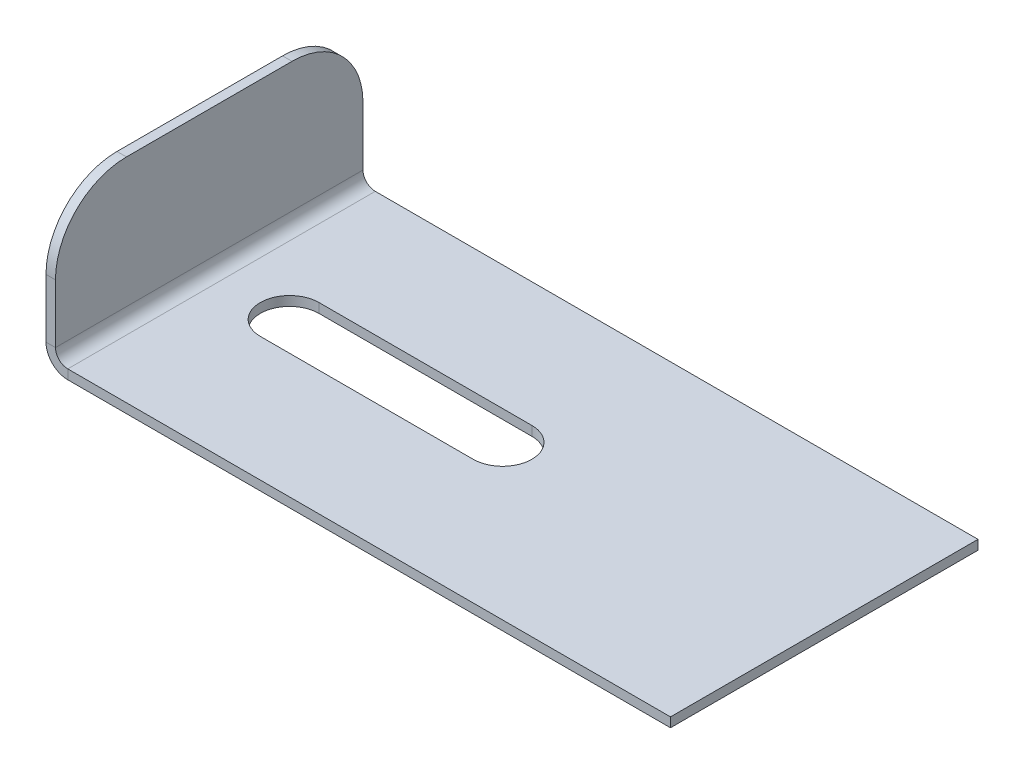
ISO-10303-21;
HEADER;
FILE_DESCRIPTION(('STEP AP214'),'2;1');
FILE_NAME('part.step','',(''),(''),'','','');
FILE_SCHEMA(('AUTOMOTIVE_DESIGN { 1 0 10303 214 1 1 1 1 }'));
ENDSEC;
DATA;
#1=APPLICATION_CONTEXT('core data for automotive mechanical design processes');
#2=APPLICATION_PROTOCOL_DEFINITION('international standard','automotive_design',2000,#1);
#3=PRODUCT_CONTEXT('',#1,'mechanical');
#4=PRODUCT('Part','Part','',(#3));
#5=PRODUCT_RELATED_PRODUCT_CATEGORY('part','',(#4));
#6=PRODUCT_DEFINITION_FORMATION('','',#4);
#7=PRODUCT_DEFINITION_CONTEXT('part definition',#1,'design');
#8=PRODUCT_DEFINITION('design','',#6,#7);
#9=PRODUCT_DEFINITION_SHAPE('','',#8);
#10=(LENGTH_UNIT() NAMED_UNIT(*) SI_UNIT(.MILLI.,.METRE.));
#11=(NAMED_UNIT(*) PLANE_ANGLE_UNIT() SI_UNIT($,.RADIAN.));
#12=(NAMED_UNIT(*) SI_UNIT($,.STERADIAN.) SOLID_ANGLE_UNIT());
#13=UNCERTAINTY_MEASURE_WITH_UNIT(LENGTH_MEASURE(1.E-05),#10,'distance_accuracy_value','');
#14=(GEOMETRIC_REPRESENTATION_CONTEXT(3) GLOBAL_UNCERTAINTY_ASSIGNED_CONTEXT((#13)) GLOBAL_UNIT_ASSIGNED_CONTEXT((#10,
#11,#12)) REPRESENTATION_CONTEXT('',''));
#15=CARTESIAN_POINT('',(0.,0.,0.));
#16=DIRECTION('',(0.,0.,1.));
#17=DIRECTION('',(1.,0.,0.));
#18=AXIS2_PLACEMENT_3D('',#15,#16,#17);
#19=CARTESIAN_POINT('',(-48.,0.,-6.2));
#20=DIRECTION('',(0.,0.,1.));
#21=DIRECTION('',(-1.,0.,0.));
#22=AXIS2_PLACEMENT_3D('',#19,#20,#21);
#23=PLANE('',#22);
#24=DIRECTION('',(0.,1.,0.));
#25=VECTOR('',#24,1.);
#26=CARTESIAN_POINT('',(-48.,0.,-6.2));
#27=LINE('',#26,#25);
#28=CARTESIAN_POINT('',(-48.,-2.,-6.2));
#29=VERTEX_POINT('',#28);
#30=CARTESIAN_POINT('',(-48.,0.,-6.2));
#31=VERTEX_POINT('',#30);
#32=EDGE_CURVE('E11',#29,#31,#27,.T.);
#33=ORIENTED_EDGE('',*,*,#32,.F.);
#34=DIRECTION('',(1.,0.,0.));
#35=VECTOR('',#34,1.);
#36=CARTESIAN_POINT('',(0.,-2.,-6.2));
#37=LINE('',#36,#35);
#38=CARTESIAN_POINT('',(-2.99999999999999,-2.,-6.2));
#39=VERTEX_POINT('',#38);
#40=EDGE_CURVE('E129',#39,#29,#37,.F.);
#41=ORIENTED_EDGE('',*,*,#40,.F.);
#42=DIRECTION('',(0.,1.,0.));
#43=VECTOR('',#42,1.);
#44=CARTESIAN_POINT('',(-2.99999999999999,0.,-6.2));
#45=LINE('',#44,#43);
#46=CARTESIAN_POINT('',(-2.99999999999999,0.,-6.2));
#47=VERTEX_POINT('',#46);
#48=EDGE_CURVE('E51',#39,#47,#45,.T.);
#49=ORIENTED_EDGE('',*,*,#48,.T.);
#50=DIRECTION('',(-1.,0.,0.));
#51=VECTOR('',#50,1.);
#52=CARTESIAN_POINT('',(-48.,0.,-6.2));
#53=LINE('',#52,#51);
#54=EDGE_CURVE('E179',#47,#31,#53,.T.);
#55=ORIENTED_EDGE('',*,*,#54,.T.);
#56=EDGE_LOOP('',(#33,#41,#49,#55));
#57=FACE_BOUND('',#56,.T.);
#58=ADVANCED_FACE('F41',(#57),#23,.T.);
#59=CARTESIAN_POINT('',(-2.99999999999999,0.,0.));
#60=DIRECTION('',(0.,-1.,0.));
#61=DIRECTION('',(0.,0.,-1.));
#62=AXIS2_PLACEMENT_3D('',#59,#60,#61);
#63=CYLINDRICAL_SURFACE('',#62,6.2);
#64=ORIENTED_EDGE('',*,*,#48,.F.);
#65=CARTESIAN_POINT('',(-2.99999999999999,-2.,0.));
#66=DIRECTION('',(0.,1.,0.));
#67=DIRECTION('',(0.,0.,1.));
#68=AXIS2_PLACEMENT_3D('',#65,#66,#67);
#69=CIRCLE('',#68,6.2);
#70=CARTESIAN_POINT('',(-2.99999999999999,-2.,6.2));
#71=VERTEX_POINT('',#70);
#72=EDGE_CURVE('E141',#71,#39,#69,.T.);
#73=ORIENTED_EDGE('',*,*,#72,.F.);
#74=DIRECTION('',(0.,1.,0.));
#75=VECTOR('',#74,1.);
#76=CARTESIAN_POINT('',(-2.99999999999999,0.,6.2));
#77=LINE('',#76,#75);
#78=CARTESIAN_POINT('',(-2.99999999999999,0.,6.2));
#79=VERTEX_POINT('',#78);
#80=EDGE_CURVE('E120',#71,#79,#77,.T.);
#81=ORIENTED_EDGE('',*,*,#80,.T.);
#82=CARTESIAN_POINT('',(-2.99999999999999,0.,0.));
#83=DIRECTION('',(0.,1.,0.));
#84=DIRECTION('',(0.,0.,1.));
#85=AXIS2_PLACEMENT_3D('',#82,#83,#84);
#86=CIRCLE('',#85,6.2);
#87=EDGE_CURVE('E188',#79,#47,#86,.T.);
#88=ORIENTED_EDGE('',*,*,#87,.T.);
#89=EDGE_LOOP('',(#64,#73,#81,#88));
#90=FACE_BOUND('',#89,.T.);
#91=ADVANCED_FACE('F191',(#90),#63,.F.);
#92=CARTESIAN_POINT('',(-48.,0.,6.2));
#93=DIRECTION('',(0.,0.,-1.));
#94=DIRECTION('',(1.,0.,0.));
#95=AXIS2_PLACEMENT_3D('',#92,#93,#94);
#96=PLANE('',#95);
#97=ORIENTED_EDGE('',*,*,#80,.F.);
#98=DIRECTION('',(1.,0.,0.));
#99=VECTOR('',#98,1.);
#100=CARTESIAN_POINT('',(0.,-2.,6.2));
#101=LINE('',#100,#99);
#102=CARTESIAN_POINT('',(-48.,-2.,6.2));
#103=VERTEX_POINT('',#102);
#104=EDGE_CURVE('E127',#103,#71,#101,.T.);
#105=ORIENTED_EDGE('',*,*,#104,.F.);
#106=DIRECTION('',(0.,1.,0.));
#107=VECTOR('',#106,1.);
#108=CARTESIAN_POINT('',(-48.,0.,6.2));
#109=LINE('',#108,#107);
#110=CARTESIAN_POINT('',(-48.,0.,6.2));
#111=VERTEX_POINT('',#110);
#112=EDGE_CURVE('E45',#103,#111,#109,.T.);
#113=ORIENTED_EDGE('',*,*,#112,.T.);
#114=DIRECTION('',(1.,0.,0.));
#115=VECTOR('',#114,1.);
#116=CARTESIAN_POINT('',(-48.,0.,6.2));
#117=LINE('',#116,#115);
#118=EDGE_CURVE('E270',#111,#79,#117,.T.);
#119=ORIENTED_EDGE('',*,*,#118,.T.);
#120=EDGE_LOOP('',(#97,#105,#113,#119));
#121=FACE_BOUND('',#120,.T.);
#122=ADVANCED_FACE('F132',(#121),#96,.T.);
#123=CARTESIAN_POINT('',(-65.,15.,-17.5));
#124=DIRECTION('',(-1.,0.,0.));
#125=DIRECTION('',(0.,-1.,0.));
#126=AXIS2_PLACEMENT_3D('',#123,#124,#125);
#127=CYLINDRICAL_SURFACE('',#126,15.);
#128=DIRECTION('',(1.,0.,0.));
#129=VECTOR('',#128,1.);
#130=CARTESIAN_POINT('',(-65.,15.,-32.5));
#131=LINE('',#130,#129);
#132=CARTESIAN_POINT('',(-67.,15.,-32.5));
#133=VERTEX_POINT('',#132);
#134=CARTESIAN_POINT('',(-65.,15.,-32.5));
#135=VERTEX_POINT('',#134);
#136=EDGE_CURVE('E121',#133,#135,#131,.T.);
#137=ORIENTED_EDGE('',*,*,#136,.F.);
#138=CARTESIAN_POINT('',(-67.,15.,-17.5));
#139=DIRECTION('',(-1.,0.,0.));
#140=DIRECTION('',(0.,-1.,0.));
#141=AXIS2_PLACEMENT_3D('',#138,#139,#140);
#142=CIRCLE('',#141,15.);
#143=CARTESIAN_POINT('',(-67.0000000000001,30.,-17.5));
#144=VERTEX_POINT('',#143);
#145=EDGE_CURVE('E281',#133,#144,#142,.F.);
#146=ORIENTED_EDGE('',*,*,#145,.T.);
#147=DIRECTION('',(1.,0.,0.));
#148=VECTOR('',#147,1.);
#149=CARTESIAN_POINT('',(-65.0000000000001,30.,-17.5));
#150=LINE('',#149,#148);
#151=CARTESIAN_POINT('',(-65.0000000000001,30.,-17.5));
#152=VERTEX_POINT('',#151);
#153=EDGE_CURVE('E167',#144,#152,#150,.T.);
#154=ORIENTED_EDGE('',*,*,#153,.T.);
#155=CARTESIAN_POINT('',(-65.,15.,-17.5));
#156=DIRECTION('',(-1.,0.,0.));
#157=DIRECTION('',(0.,-1.,0.));
#158=AXIS2_PLACEMENT_3D('',#155,#156,#157);
#159=CIRCLE('',#158,15.);
#160=EDGE_CURVE('E217',#135,#152,#159,.F.);
#161=ORIENTED_EDGE('',*,*,#160,.F.);
#162=EDGE_LOOP('',(#137,#146,#154,#161));
#163=FACE_BOUND('',#162,.T.);
#164=ADVANCED_FACE('F349',(#163),#127,.T.);
#165=CARTESIAN_POINT('',(-65.0000000000001,30.,32.5));
#166=DIRECTION('',(0.,-1.,0.));
#167=DIRECTION('',(0.,0.,1.));
#168=AXIS2_PLACEMENT_3D('',#165,#166,#167);
#169=PLANE('',#168);
#170=ORIENTED_EDGE('',*,*,#153,.F.);
#171=DIRECTION('',(0.,0.,1.));
#172=VECTOR('',#171,1.);
#173=CARTESIAN_POINT('',(-67.0000000000001,30.,0.));
#174=LINE('',#173,#172);
#175=CARTESIAN_POINT('',(-67.0000000000001,30.,17.5));
#176=VERTEX_POINT('',#175);
#177=EDGE_CURVE('E278',#144,#176,#174,.T.);
#178=ORIENTED_EDGE('',*,*,#177,.T.);
#179=DIRECTION('',(1.,0.,0.));
#180=VECTOR('',#179,1.);
#181=CARTESIAN_POINT('',(-65.0000000000001,30.,17.5));
#182=LINE('',#181,#180);
#183=CARTESIAN_POINT('',(-65.0000000000001,30.,17.5));
#184=VERTEX_POINT('',#183);
#185=EDGE_CURVE('E164',#176,#184,#182,.T.);
#186=ORIENTED_EDGE('',*,*,#185,.T.);
#187=DIRECTION('',(0.,0.,1.));
#188=VECTOR('',#187,1.);
#189=CARTESIAN_POINT('',(-65.0000000000001,30.,32.5));
#190=LINE('',#189,#188);
#191=EDGE_CURVE('E221',#152,#184,#190,.T.);
#192=ORIENTED_EDGE('',*,*,#191,.F.);
#193=EDGE_LOOP('',(#170,#178,#186,#192));
#194=FACE_BOUND('',#193,.T.);
#195=ADVANCED_FACE('F351',(#194),#169,.F.);
#196=CARTESIAN_POINT('',(-65.,15.,17.5));
#197=DIRECTION('',(-1.,0.,0.));
#198=DIRECTION('',(0.,-1.,0.));
#199=AXIS2_PLACEMENT_3D('',#196,#197,#198);
#200=CYLINDRICAL_SURFACE('',#199,15.);
#201=ORIENTED_EDGE('',*,*,#185,.F.);
#202=CARTESIAN_POINT('',(-67.,15.,17.5));
#203=DIRECTION('',(-1.,0.,0.));
#204=DIRECTION('',(0.,-1.,0.));
#205=AXIS2_PLACEMENT_3D('',#202,#203,#204);
#206=CIRCLE('',#205,15.);
#207=CARTESIAN_POINT('',(-67.,15.,32.5));
#208=VERTEX_POINT('',#207);
#209=EDGE_CURVE('E274',#176,#208,#206,.F.);
#210=ORIENTED_EDGE('',*,*,#209,.T.);
#211=DIRECTION('',(1.,0.,0.));
#212=VECTOR('',#211,1.);
#213=CARTESIAN_POINT('',(-65.,15.,32.5));
#214=LINE('',#213,#212);
#215=CARTESIAN_POINT('',(-65.,15.,32.5));
#216=VERTEX_POINT('',#215);
#217=EDGE_CURVE('E161',#208,#216,#214,.T.);
#218=ORIENTED_EDGE('',*,*,#217,.T.);
#219=CARTESIAN_POINT('',(-65.,15.,17.5));
#220=DIRECTION('',(-1.,0.,0.));
#221=DIRECTION('',(0.,-1.,0.));
#222=AXIS2_PLACEMENT_3D('',#219,#220,#221);
#223=CIRCLE('',#222,15.);
#224=EDGE_CURVE('E225',#184,#216,#223,.F.);
#225=ORIENTED_EDGE('',*,*,#224,.F.);
#226=EDGE_LOOP('',(#201,#210,#218,#225));
#227=FACE_BOUND('',#226,.T.);
#228=ADVANCED_FACE('F337',(#227),#200,.T.);
#229=CARTESIAN_POINT('',(-65.,0.,32.5));
#230=DIRECTION('',(0.,0.,-1.));
#231=DIRECTION('',(0.,-1.,0.));
#232=AXIS2_PLACEMENT_3D('',#229,#230,#231);
#233=PLANE('',#232);
#234=ORIENTED_EDGE('',*,*,#217,.F.);
#235=DIRECTION('',(0.,-1.,0.));
#236=VECTOR('',#235,1.);
#237=CARTESIAN_POINT('',(-67.,-2.47949808832952E-13,32.5));
#238=LINE('',#237,#236);
#239=CARTESIAN_POINT('',(-67.,2.59999999999998,32.5));
#240=VERTEX_POINT('',#239);
#241=EDGE_CURVE('E252',#208,#240,#238,.T.);
#242=ORIENTED_EDGE('',*,*,#241,.T.);
#243=DIRECTION('',(1.,0.,0.));
#244=VECTOR('',#243,1.);
#245=CARTESIAN_POINT('',(-65.,2.59999999999999,32.5));
#246=LINE('',#245,#244);
#247=CARTESIAN_POINT('',(-65.,2.59999999999999,32.5));
#248=VERTEX_POINT('',#247);
#249=EDGE_CURVE('E159',#240,#248,#246,.T.);
#250=ORIENTED_EDGE('',*,*,#249,.T.);
#251=DIRECTION('',(0.,-1.,0.));
#252=VECTOR('',#251,1.);
#253=CARTESIAN_POINT('',(-65.,0.,32.5));
#254=LINE('',#253,#252);
#255=EDGE_CURVE('E229',#216,#248,#254,.T.);
#256=ORIENTED_EDGE('',*,*,#255,.F.);
#257=EDGE_LOOP('',(#234,#242,#250,#256));
#258=FACE_BOUND('',#257,.T.);
#259=ADVANCED_FACE('F345',(#258),#233,.F.);
#260=CARTESIAN_POINT('',(-62.4,2.6,32.5));
#261=DIRECTION('',(0.,0.,-1.));
#262=DIRECTION('',(-1.,0.,0.));
#263=AXIS2_PLACEMENT_3D('',#260,#261,#262);
#264=PLANE('',#263);
#265=ORIENTED_EDGE('',*,*,#249,.F.);
#266=CARTESIAN_POINT('',(-62.4,2.6,32.5));
#267=DIRECTION('',(0.,0.,1.));
#268=DIRECTION('',(1.,0.,0.));
#269=AXIS2_PLACEMENT_3D('',#266,#267,#268);
#270=CIRCLE('',#269,4.6);
#271=CARTESIAN_POINT('',(-62.4,-2.,32.5));
#272=VERTEX_POINT('',#271);
#273=EDGE_CURVE('E255',#240,#272,#270,.T.);
#274=ORIENTED_EDGE('',*,*,#273,.T.);
#275=DIRECTION('',(0.,1.,0.));
#276=VECTOR('',#275,1.);
#277=CARTESIAN_POINT('',(-62.4,0.,32.5));
#278=LINE('',#277,#276);
#279=CARTESIAN_POINT('',(-62.4,0.,32.5));
#280=VERTEX_POINT('',#279);
#281=EDGE_CURVE('E156',#272,#280,#278,.T.);
#282=ORIENTED_EDGE('',*,*,#281,.T.);
#283=CARTESIAN_POINT('',(-62.4,2.6,32.5));
#284=DIRECTION('',(0.,0.,1.));
#285=DIRECTION('',(1.,0.,0.));
#286=AXIS2_PLACEMENT_3D('',#283,#284,#285);
#287=CIRCLE('',#286,2.6);
#288=EDGE_CURVE('E173',#248,#280,#287,.T.);
#289=ORIENTED_EDGE('',*,*,#288,.F.);
#290=EDGE_LOOP('',(#265,#274,#282,#289));
#291=FACE_BOUND('',#290,.T.);
#292=ADVANCED_FACE('F347',(#291),#264,.F.);
#293=CARTESIAN_POINT('',(-65.,0.,32.5));
#294=DIRECTION('',(0.,0.,-1.));
#295=DIRECTION('',(1.,0.,0.));
#296=AXIS2_PLACEMENT_3D('',#293,#294,#295);
#297=PLANE('',#296);
#298=ORIENTED_EDGE('',*,*,#281,.F.);
#299=DIRECTION('',(1.,0.,0.));
#300=VECTOR('',#299,1.);
#301=CARTESIAN_POINT('',(0.,-2.,32.5));
#302=LINE('',#301,#300);
#303=CARTESIAN_POINT('',(65.,-2.,32.5));
#304=VERTEX_POINT('',#303);
#305=EDGE_CURVE('E246',#272,#304,#302,.T.);
#306=ORIENTED_EDGE('',*,*,#305,.T.);
#307=DIRECTION('',(0.,1.,0.));
#308=VECTOR('',#307,1.);
#309=CARTESIAN_POINT('',(65.,0.,32.5));
#310=LINE('',#309,#308);
#311=CARTESIAN_POINT('',(65.,0.,32.5));
#312=VERTEX_POINT('',#311);
#313=EDGE_CURVE('E153',#304,#312,#310,.T.);
#314=ORIENTED_EDGE('',*,*,#313,.T.);
#315=DIRECTION('',(1.,0.,0.));
#316=VECTOR('',#315,1.);
#317=CARTESIAN_POINT('',(-65.,0.,32.5));
#318=LINE('',#317,#316);
#319=EDGE_CURVE('E198',#280,#312,#318,.T.);
#320=ORIENTED_EDGE('',*,*,#319,.F.);
#321=EDGE_LOOP('',(#298,#306,#314,#320));
#322=FACE_BOUND('',#321,.T.);
#323=ADVANCED_FACE('F320',(#322),#297,.F.);
#324=CARTESIAN_POINT('',(65.,0.,32.5));
#325=DIRECTION('',(-1.,0.,0.));
#326=DIRECTION('',(0.,0.,-1.));
#327=AXIS2_PLACEMENT_3D('',#324,#325,#326);
#328=PLANE('',#327);
#329=ORIENTED_EDGE('',*,*,#313,.F.);
#330=DIRECTION('',(0.,0.,-1.));
#331=VECTOR('',#330,1.);
#332=CARTESIAN_POINT('',(65.,-2.,0.));
#333=LINE('',#332,#331);
#334=CARTESIAN_POINT('',(65.,-2.,-32.5));
#335=VERTEX_POINT('',#334);
#336=EDGE_CURVE('E260',#304,#335,#333,.T.);
#337=ORIENTED_EDGE('',*,*,#336,.T.);
#338=DIRECTION('',(0.,1.,0.));
#339=VECTOR('',#338,1.);
#340=CARTESIAN_POINT('',(65.,0.,-32.5));
#341=LINE('',#340,#339);
#342=CARTESIAN_POINT('',(65.,0.,-32.5));
#343=VERTEX_POINT('',#342);
#344=EDGE_CURVE('E150',#335,#343,#341,.T.);
#345=ORIENTED_EDGE('',*,*,#344,.T.);
#346=DIRECTION('',(0.,0.,-1.));
#347=VECTOR('',#346,1.);
#348=CARTESIAN_POINT('',(65.,0.,32.5));
#349=LINE('',#348,#347);
#350=EDGE_CURVE('E205',#312,#343,#349,.T.);
#351=ORIENTED_EDGE('',*,*,#350,.F.);
#352=EDGE_LOOP('',(#329,#337,#345,#351));
#353=FACE_BOUND('',#352,.T.);
#354=ADVANCED_FACE('F314',(#353),#328,.F.);
#355=CARTESIAN_POINT('',(-65.,0.,-32.5));
#356=DIRECTION('',(0.,0.,1.));
#357=DIRECTION('',(-1.,0.,0.));
#358=AXIS2_PLACEMENT_3D('',#355,#356,#357);
#359=PLANE('',#358);
#360=ORIENTED_EDGE('',*,*,#344,.F.);
#361=DIRECTION('',(1.,0.,0.));
#362=VECTOR('',#361,1.);
#363=CARTESIAN_POINT('',(0.,-2.,-32.5));
#364=LINE('',#363,#362);
#365=CARTESIAN_POINT('',(-62.4,-2.,-32.4999999999999));
#366=VERTEX_POINT('',#365);
#367=EDGE_CURVE('E256',#335,#366,#364,.F.);
#368=ORIENTED_EDGE('',*,*,#367,.T.);
#369=DIRECTION('',(0.,1.,0.));
#370=VECTOR('',#369,1.);
#371=CARTESIAN_POINT('',(-62.4,0.,-32.5));
#372=LINE('',#371,#370);
#373=CARTESIAN_POINT('',(-62.4,0.,-32.5));
#374=VERTEX_POINT('',#373);
#375=EDGE_CURVE('E147',#366,#374,#372,.T.);
#376=ORIENTED_EDGE('',*,*,#375,.T.);
#377=DIRECTION('',(-1.,0.,0.));
#378=VECTOR('',#377,1.);
#379=CARTESIAN_POINT('',(-65.,0.,-32.5));
#380=LINE('',#379,#378);
#381=EDGE_CURVE('E209',#343,#374,#380,.T.);
#382=ORIENTED_EDGE('',*,*,#381,.F.);
#383=EDGE_LOOP('',(#360,#368,#376,#382));
#384=FACE_BOUND('',#383,.T.);
#385=ADVANCED_FACE('F309',(#384),#359,.F.);
#386=CARTESIAN_POINT('',(-62.4,2.6,-32.5));
#387=DIRECTION('',(0.,0.,-1.));
#388=DIRECTION('',(-1.,0.,0.));
#389=AXIS2_PLACEMENT_3D('',#386,#387,#388);
#390=PLANE('',#389);
#391=ORIENTED_EDGE('',*,*,#375,.F.);
#392=CARTESIAN_POINT('',(-62.4,2.6,-32.4999999999999));
#393=DIRECTION('',(0.,0.,1.));
#394=DIRECTION('',(1.,0.,0.));
#395=AXIS2_PLACEMENT_3D('',#392,#393,#394);
#396=CIRCLE('',#395,4.6);
#397=CARTESIAN_POINT('',(-67.,2.59999999999998,-32.4999999999999));
#398=VERTEX_POINT('',#397);
#399=EDGE_CURVE('E251',#366,#398,#396,.F.);
#400=ORIENTED_EDGE('',*,*,#399,.T.);
#401=DIRECTION('',(1.,0.,0.));
#402=VECTOR('',#401,1.);
#403=CARTESIAN_POINT('',(-65.,2.59999999999999,-32.5));
#404=LINE('',#403,#402);
#405=CARTESIAN_POINT('',(-65.,2.59999999999999,-32.5));
#406=VERTEX_POINT('',#405);
#407=EDGE_CURVE('E59',#398,#406,#404,.T.);
#408=ORIENTED_EDGE('',*,*,#407,.T.);
#409=CARTESIAN_POINT('',(-62.4,2.6,-32.5));
#410=DIRECTION('',(0.,0.,1.));
#411=DIRECTION('',(1.,0.,0.));
#412=AXIS2_PLACEMENT_3D('',#409,#410,#411);
#413=CIRCLE('',#412,2.6);
#414=EDGE_CURVE('E237',#374,#406,#413,.F.);
#415=ORIENTED_EDGE('',*,*,#414,.F.);
#416=EDGE_LOOP('',(#391,#400,#408,#415));
#417=FACE_BOUND('',#416,.T.);
#418=ADVANCED_FACE('F301',(#417),#390,.T.);
#419=CARTESIAN_POINT('',(-48.,0.,0.));
#420=DIRECTION('',(0.,-1.,0.));
#421=DIRECTION('',(0.,0.,-1.));
#422=AXIS2_PLACEMENT_3D('',#419,#420,#421);
#423=CYLINDRICAL_SURFACE('',#422,6.2);
#424=CARTESIAN_POINT('',(-48.,-2.,0.));
#425=DIRECTION('',(0.,1.,0.));
#426=DIRECTION('',(0.,0.,1.));
#427=AXIS2_PLACEMENT_3D('',#424,#425,#426);
#428=CIRCLE('',#427,6.2);
#429=EDGE_CURVE('E113',#29,#103,#428,.T.);
#430=ORIENTED_EDGE('',*,*,#429,.F.);
#431=ORIENTED_EDGE('',*,*,#32,.T.);
#432=CARTESIAN_POINT('',(-48.,0.,0.));
#433=DIRECTION('',(0.,1.,0.));
#434=DIRECTION('',(0.,0.,1.));
#435=AXIS2_PLACEMENT_3D('',#432,#433,#434);
#436=CIRCLE('',#435,6.2);
#437=EDGE_CURVE('E115',#31,#111,#436,.T.);
#438=ORIENTED_EDGE('',*,*,#437,.T.);
#439=ORIENTED_EDGE('',*,*,#112,.F.);
#440=EDGE_LOOP('',(#430,#431,#438,#439));
#441=FACE_BOUND('',#440,.T.);
#442=ADVANCED_FACE('F43',(#441),#423,.F.);
#443=CARTESIAN_POINT('',(-65.0000000000001,30.,-32.5));
#444=DIRECTION('',(0.,0.,1.));
#445=DIRECTION('',(0.,1.,0.));
#446=AXIS2_PLACEMENT_3D('',#443,#444,#445);
#447=PLANE('',#446);
#448=DIRECTION('',(0.,-1.,0.));
#449=VECTOR('',#448,1.);
#450=CARTESIAN_POINT('',(-67.,-2.47949808832952E-13,-32.5));
#451=LINE('',#450,#449);
#452=EDGE_CURVE('E139',#398,#133,#451,.F.);
#453=ORIENTED_EDGE('',*,*,#452,.T.);
#454=ORIENTED_EDGE('',*,*,#136,.T.);
#455=DIRECTION('',(0.,1.,0.));
#456=VECTOR('',#455,1.);
#457=CARTESIAN_POINT('',(-65.0000000000001,30.,-32.5));
#458=LINE('',#457,#456);
#459=EDGE_CURVE('E213',#406,#135,#458,.T.);
#460=ORIENTED_EDGE('',*,*,#459,.F.);
#461=ORIENTED_EDGE('',*,*,#407,.F.);
#462=EDGE_LOOP('',(#453,#454,#460,#461));
#463=FACE_BOUND('',#462,.T.);
#464=ADVANCED_FACE('F292',(#463),#447,.F.);
#465=CARTESIAN_POINT('',(-62.4,2.6,32.5));
#466=DIRECTION('',(0.,0.,1.));
#467=DIRECTION('',(-1.,0.,0.));
#468=AXIS2_PLACEMENT_3D('',#465,#466,#467);
#469=CYLINDRICAL_SURFACE('',#468,2.6);
#470=DIRECTION('',(0.,0.,1.));
#471=VECTOR('',#470,1.);
#472=CARTESIAN_POINT('',(-62.4,0.,32.5));
#473=LINE('',#472,#471);
#474=EDGE_CURVE('E193',#280,#374,#473,.F.);
#475=ORIENTED_EDGE('',*,*,#474,.T.);
#476=ORIENTED_EDGE('',*,*,#414,.T.);
#477=DIRECTION('',(0.,0.,1.));
#478=VECTOR('',#477,1.);
#479=CARTESIAN_POINT('',(-65.,2.59999999999999,-32.5));
#480=LINE('',#479,#478);
#481=EDGE_CURVE('E233',#406,#248,#480,.T.);
#482=ORIENTED_EDGE('',*,*,#481,.T.);
#483=ORIENTED_EDGE('',*,*,#288,.T.);
#484=EDGE_LOOP('',(#475,#476,#482,#483));
#485=FACE_BOUND('',#484,.T.);
#486=ADVANCED_FACE('F326',(#485),#469,.F.);
#487=CARTESIAN_POINT('',(-65.,-2.40548322002117E-13,0.));
#488=DIRECTION('',(-1.,0.,0.));
#489=DIRECTION('',(0.,-1.,0.));
#490=AXIS2_PLACEMENT_3D('',#487,#488,#489);
#491=PLANE('',#490);
#492=ORIENTED_EDGE('',*,*,#459,.T.);
#493=ORIENTED_EDGE('',*,*,#160,.T.);
#494=ORIENTED_EDGE('',*,*,#191,.T.);
#495=ORIENTED_EDGE('',*,*,#224,.T.);
#496=ORIENTED_EDGE('',*,*,#255,.T.);
#497=ORIENTED_EDGE('',*,*,#481,.F.);
#498=EDGE_LOOP('',(#492,#493,#494,#495,#496,#497));
#499=FACE_BOUND('',#498,.T.);
#500=ADVANCED_FACE('F342',(#499),#491,.F.);
#501=CARTESIAN_POINT('',(0.,0.,0.));
#502=DIRECTION('',(0.,-1.,0.));
#503=DIRECTION('',(0.,0.,-1.));
#504=AXIS2_PLACEMENT_3D('',#501,#502,#503);
#505=PLANE('',#504);
#506=ORIENTED_EDGE('',*,*,#118,.F.);
#507=ORIENTED_EDGE('',*,*,#437,.F.);
#508=ORIENTED_EDGE('',*,*,#54,.F.);
#509=ORIENTED_EDGE('',*,*,#87,.F.);
#510=EDGE_LOOP('',(#506,#507,#508,#509));
#511=FACE_BOUND('',#510,.T.);
#512=ORIENTED_EDGE('',*,*,#474,.F.);
#513=ORIENTED_EDGE('',*,*,#319,.T.);
#514=ORIENTED_EDGE('',*,*,#350,.T.);
#515=ORIENTED_EDGE('',*,*,#381,.T.);
#516=EDGE_LOOP('',(#512,#513,#514,#515));
#517=FACE_BOUND('',#516,.T.);
#518=ADVANCED_FACE('F186',(#511,#517),#505,.F.);
#519=CARTESIAN_POINT('',(-62.4,2.6,32.5));
#520=DIRECTION('',(0.,0.,1.));
#521=DIRECTION('',(-1.,0.,0.));
#522=AXIS2_PLACEMENT_3D('',#519,#520,#521);
#523=CYLINDRICAL_SURFACE('',#522,4.6);
#524=DIRECTION('',(0.,0.,1.));
#525=VECTOR('',#524,1.);
#526=CARTESIAN_POINT('',(-62.4,-2.,32.5));
#527=LINE('',#526,#525);
#528=EDGE_CURVE('E144',#272,#366,#527,.F.);
#529=ORIENTED_EDGE('',*,*,#528,.F.);
#530=ORIENTED_EDGE('',*,*,#273,.F.);
#531=DIRECTION('',(0.,0.,1.));
#532=VECTOR('',#531,1.);
#533=CARTESIAN_POINT('',(-67.,2.59999999999998,32.5));
#534=LINE('',#533,#532);
#535=EDGE_CURVE('E247',#398,#240,#534,.T.);
#536=ORIENTED_EDGE('',*,*,#535,.F.);
#537=ORIENTED_EDGE('',*,*,#399,.F.);
#538=EDGE_LOOP('',(#529,#530,#536,#537));
#539=FACE_BOUND('',#538,.T.);
#540=ADVANCED_FACE('F304',(#539),#523,.T.);
#541=CARTESIAN_POINT('',(-67.,-2.47949808832952E-13,0.));
#542=DIRECTION('',(-1.,0.,0.));
#543=DIRECTION('',(0.,-1.,0.));
#544=AXIS2_PLACEMENT_3D('',#541,#542,#543);
#545=PLANE('',#544);
#546=ORIENTED_EDGE('',*,*,#452,.F.);
#547=ORIENTED_EDGE('',*,*,#535,.T.);
#548=ORIENTED_EDGE('',*,*,#241,.F.);
#549=ORIENTED_EDGE('',*,*,#209,.F.);
#550=ORIENTED_EDGE('',*,*,#177,.F.);
#551=ORIENTED_EDGE('',*,*,#145,.F.);
#552=EDGE_LOOP('',(#546,#547,#548,#549,#550,#551));
#553=FACE_BOUND('',#552,.T.);
#554=ADVANCED_FACE('F297',(#553),#545,.T.);
#555=CARTESIAN_POINT('',(0.,-2.,0.));
#556=DIRECTION('',(0.,-1.,0.));
#557=DIRECTION('',(0.,0.,-1.));
#558=AXIS2_PLACEMENT_3D('',#555,#556,#557);
#559=PLANE('',#558);
#560=ORIENTED_EDGE('',*,*,#104,.T.);
#561=ORIENTED_EDGE('',*,*,#72,.T.);
#562=ORIENTED_EDGE('',*,*,#40,.T.);
#563=ORIENTED_EDGE('',*,*,#429,.T.);
#564=EDGE_LOOP('',(#560,#561,#562,#563));
#565=FACE_BOUND('',#564,.T.);
#566=ORIENTED_EDGE('',*,*,#528,.T.);
#567=ORIENTED_EDGE('',*,*,#367,.F.);
#568=ORIENTED_EDGE('',*,*,#336,.F.);
#569=ORIENTED_EDGE('',*,*,#305,.F.);
#570=EDGE_LOOP('',(#566,#567,#568,#569));
#571=FACE_BOUND('',#570,.T.);
#572=ADVANCED_FACE('F124',(#565,#571),#559,.T.);
#573=CLOSED_SHELL('',(#58,#91,#122,#164,#195,#228,#259,#292,#323,#354,#385,#418,#442,#464,#486,
#500,#518,#540,#554,#572));
#574=MANIFOLD_SOLID_BREP('B2',#573);
#575=ADVANCED_BREP_SHAPE_REPRESENTATION('',(#18,#574),#14);
#576=SHAPE_DEFINITION_REPRESENTATION(#9,#575);
ENDSEC;
END-ISO-10303-21;
